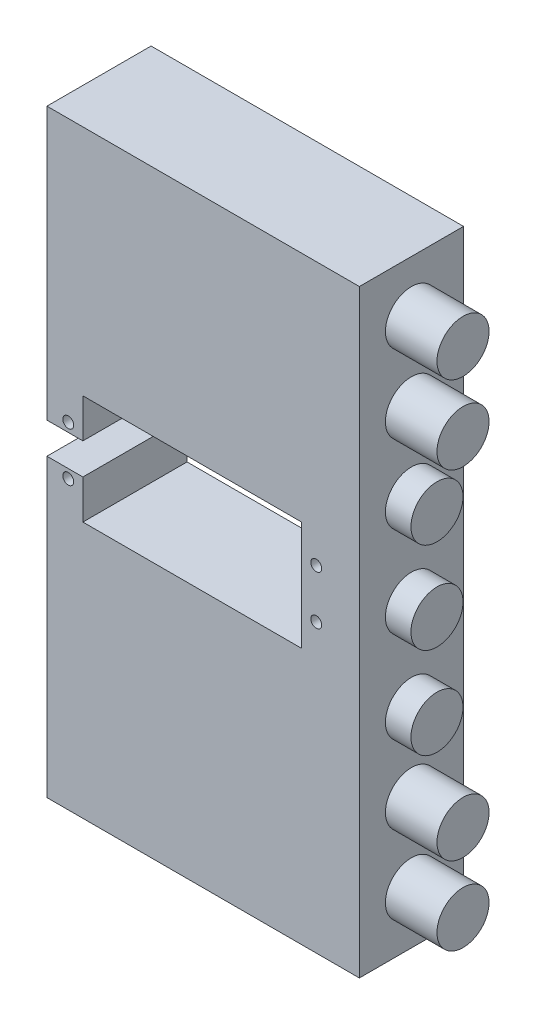
ISO-10303-21;
HEADER;
FILE_DESCRIPTION(('STEP AP214'),'2;1');
FILE_NAME('part.step','',(''),(''),'','','');
FILE_SCHEMA(('AUTOMOTIVE_DESIGN { 1 0 10303 214 1 1 1 1 }'));
ENDSEC;
DATA;
#1=APPLICATION_CONTEXT('core data for automotive mechanical design processes');
#2=APPLICATION_PROTOCOL_DEFINITION('international standard','automotive_design',2000,#1);
#3=PRODUCT_CONTEXT('',#1,'mechanical');
#4=PRODUCT('Part','Part','',(#3));
#5=PRODUCT_RELATED_PRODUCT_CATEGORY('part','',(#4));
#6=PRODUCT_DEFINITION_FORMATION('','',#4);
#7=PRODUCT_DEFINITION_CONTEXT('part definition',#1,'design');
#8=PRODUCT_DEFINITION('design','',#6,#7);
#9=PRODUCT_DEFINITION_SHAPE('','',#8);
#10=(LENGTH_UNIT() NAMED_UNIT(*) SI_UNIT(.MILLI.,.METRE.));
#11=(NAMED_UNIT(*) PLANE_ANGLE_UNIT() SI_UNIT($,.RADIAN.));
#12=(NAMED_UNIT(*) SI_UNIT($,.STERADIAN.) SOLID_ANGLE_UNIT());
#13=UNCERTAINTY_MEASURE_WITH_UNIT(LENGTH_MEASURE(1.E-05),#10,'distance_accuracy_value','');
#14=(GEOMETRIC_REPRESENTATION_CONTEXT(3) GLOBAL_UNCERTAINTY_ASSIGNED_CONTEXT((#13)) GLOBAL_UNIT_ASSIGNED_CONTEXT((#10,
#11,#12)) REPRESENTATION_CONTEXT('',''));
#15=CARTESIAN_POINT('',(0.,0.,0.));
#16=DIRECTION('',(0.,0.,1.));
#17=DIRECTION('',(1.,0.,0.));
#18=AXIS2_PLACEMENT_3D('',#15,#16,#17);
#19=CARTESIAN_POINT('',(55.0953192291233,52.2228621081059,20.));
#20=DIRECTION('',(1.,0.,0.));
#21=DIRECTION('',(0.,1.,0.));
#22=AXIS2_PLACEMENT_3D('',#19,#20,#21);
#23=PLANE('',#22);
#24=DIRECTION('',(0.,0.,1.));
#25=VECTOR('',#24,1.);
#26=CARTESIAN_POINT('',(55.0953192291233,-6.,20.));
#27=LINE('',#26,#25);
#28=CARTESIAN_POINT('',(55.0953192291233,-6.,0.));
#29=VERTEX_POINT('',#28);
#30=CARTESIAN_POINT('',(55.0953192291233,-6.,20.));
#31=VERTEX_POINT('',#30);
#32=EDGE_CURVE('E204',#29,#31,#27,.T.);
#33=ORIENTED_EDGE('',*,*,#32,.F.);
#34=DIRECTION('',(0.,-1.,0.));
#35=VECTOR('',#34,1.);
#36=CARTESIAN_POINT('',(55.0953192291233,52.2228621081059,0.));
#37=LINE('',#36,#35);
#38=CARTESIAN_POINT('',(55.0953192291233,-62.7771378918941,0.));
#39=VERTEX_POINT('',#38);
#40=EDGE_CURVE('E281',#29,#39,#37,.T.);
#41=ORIENTED_EDGE('',*,*,#40,.T.);
#42=DIRECTION('',(0.,0.,-1.));
#43=VECTOR('',#42,1.);
#44=CARTESIAN_POINT('',(55.0953192291233,-62.7771378918941,20.));
#45=LINE('',#44,#43);
#46=CARTESIAN_POINT('',(55.0953192291233,-62.7771378918941,20.));
#47=VERTEX_POINT('',#46);
#48=EDGE_CURVE('E315',#47,#39,#45,.T.);
#49=ORIENTED_EDGE('',*,*,#48,.F.);
#50=DIRECTION('',(0.,-1.,0.));
#51=VECTOR('',#50,1.);
#52=CARTESIAN_POINT('',(55.0953192291233,52.2228621081059,20.));
#53=LINE('',#52,#51);
#54=EDGE_CURVE('E152',#31,#47,#53,.T.);
#55=ORIENTED_EDGE('',*,*,#54,.F.);
#56=EDGE_LOOP('',(#33,#41,#49,#55));
#57=FACE_BOUND('',#56,.T.);
#58=ADVANCED_FACE('F99',(#57),#23,.F.);
#59=CARTESIAN_POINT('',(0.,0.,20.));
#60=DIRECTION('',(0.,0.,1.));
#61=DIRECTION('',(1.,0.,0.));
#62=AXIS2_PLACEMENT_3D('',#59,#60,#61);
#63=PLANE('',#62);
#64=CARTESIAN_POINT('',(106.81,1.7,20.));
#65=DIRECTION('',(0.,0.,1.));
#66=DIRECTION('',(1.,0.,0.));
#67=AXIS2_PLACEMENT_3D('',#64,#65,#66);
#68=CIRCLE('',#67,1.04999999999999);
#69=CARTESIAN_POINT('',(107.86,1.7,20.));
#70=VERTEX_POINT('',#69);
#71=EDGE_CURVE('E724',#70,#70,#68,.T.);
#72=ORIENTED_EDGE('',*,*,#71,.F.);
#73=EDGE_LOOP('',(#72));
#74=FACE_BOUND('',#73,.T.);
#75=DIRECTION('',(0.,-1.,0.));
#76=VECTOR('',#75,1.);
#77=CARTESIAN_POINT('',(62.,-6.,20.));
#78=LINE('',#77,#76);
#79=CARTESIAN_POINT('',(62.,-6.,20.));
#80=VERTEX_POINT('',#79);
#81=CARTESIAN_POINT('',(62.,-13.5,20.));
#82=VERTEX_POINT('',#81);
#83=EDGE_CURVE('E207',#80,#82,#78,.T.);
#84=ORIENTED_EDGE('',*,*,#83,.F.);
#85=DIRECTION('',(1.,0.,0.));
#86=VECTOR('',#85,1.);
#87=CARTESIAN_POINT('',(55.,-6.,20.));
#88=LINE('',#87,#86);
#89=EDGE_CURVE('E198',#31,#80,#88,.T.);
#90=ORIENTED_EDGE('',*,*,#89,.F.);
#91=ORIENTED_EDGE('',*,*,#54,.T.);
#92=DIRECTION('',(1.,0.,0.));
#93=VECTOR('',#92,1.);
#94=CARTESIAN_POINT('',(55.0953192291233,-62.7771378918941,20.));
#95=LINE('',#94,#93);
#96=CARTESIAN_POINT('',(115.095319229123,-62.7771378918941,20.));
#97=VERTEX_POINT('',#96);
#98=EDGE_CURVE('E285',#47,#97,#95,.T.);
#99=ORIENTED_EDGE('',*,*,#98,.T.);
#100=DIRECTION('',(0.,1.,0.));
#101=VECTOR('',#100,1.);
#102=CARTESIAN_POINT('',(115.095319229123,52.2228621081059,20.));
#103=LINE('',#102,#101);
#104=CARTESIAN_POINT('',(115.095319229123,52.2228621081059,20.));
#105=VERTEX_POINT('',#104);
#106=EDGE_CURVE('E288',#97,#105,#103,.T.);
#107=ORIENTED_EDGE('',*,*,#106,.T.);
#108=DIRECTION('',(-1.,0.,0.));
#109=VECTOR('',#108,1.);
#110=CARTESIAN_POINT('',(55.0953192291233,52.2228621081059,20.));
#111=LINE('',#110,#109);
#112=CARTESIAN_POINT('',(55.0953192291233,52.2228621081059,20.));
#113=VERTEX_POINT('',#112);
#114=EDGE_CURVE('E124',#105,#113,#111,.T.);
#115=ORIENTED_EDGE('',*,*,#114,.T.);
#116=CARTESIAN_POINT('',(55.0953192291233,0.,20.));
#117=VERTEX_POINT('',#116);
#118=EDGE_CURVE('E282',#113,#117,#53,.T.);
#119=ORIENTED_EDGE('',*,*,#118,.T.);
#120=DIRECTION('',(1.,0.,0.));
#121=VECTOR('',#120,1.);
#122=CARTESIAN_POINT('',(55.,0.,20.));
#123=LINE('',#122,#121);
#124=CARTESIAN_POINT('',(62.,0.,20.));
#125=VERTEX_POINT('',#124);
#126=EDGE_CURVE('E240',#117,#125,#123,.T.);
#127=ORIENTED_EDGE('',*,*,#126,.T.);
#128=DIRECTION('',(0.,1.,0.));
#129=VECTOR('',#128,1.);
#130=CARTESIAN_POINT('',(62.,0.,20.));
#131=LINE('',#130,#129);
#132=CARTESIAN_POINT('',(62.,7.5,20.));
#133=VERTEX_POINT('',#132);
#134=EDGE_CURVE('E236',#125,#133,#131,.T.);
#135=ORIENTED_EDGE('',*,*,#134,.T.);
#136=DIRECTION('',(1.,0.,0.));
#137=VECTOR('',#136,1.);
#138=CARTESIAN_POINT('',(62.,7.5,20.));
#139=LINE('',#138,#137);
#140=CARTESIAN_POINT('',(104.,7.5,20.));
#141=VERTEX_POINT('',#140);
#142=EDGE_CURVE('E232',#133,#141,#139,.T.);
#143=ORIENTED_EDGE('',*,*,#142,.T.);
#144=DIRECTION('',(0.,-1.,0.));
#145=VECTOR('',#144,1.);
#146=CARTESIAN_POINT('',(104.,7.5,20.));
#147=LINE('',#146,#145);
#148=CARTESIAN_POINT('',(104.,-13.5,20.));
#149=VERTEX_POINT('',#148);
#150=EDGE_CURVE('E226',#141,#149,#147,.T.);
#151=ORIENTED_EDGE('',*,*,#150,.T.);
#152=DIRECTION('',(1.,0.,0.));
#153=VECTOR('',#152,1.);
#154=CARTESIAN_POINT('',(62.,-13.5,20.));
#155=LINE('',#154,#153);
#156=EDGE_CURVE('E222',#82,#149,#155,.T.);
#157=ORIENTED_EDGE('',*,*,#156,.F.);
#158=EDGE_LOOP('',(#84,#90,#91,#99,#107,#115,#119,#127,#135,#143,#151,#157));
#159=FACE_BOUND('',#158,.T.);
#160=CARTESIAN_POINT('',(106.81,-7.7,20.));
#161=DIRECTION('',(0.,0.,-1.));
#162=DIRECTION('',(-1.,0.,0.));
#163=AXIS2_PLACEMENT_3D('',#160,#161,#162);
#164=CIRCLE('',#163,1.04999999999999);
#165=CARTESIAN_POINT('',(105.76,-7.7,20.));
#166=VERTEX_POINT('',#165);
#167=EDGE_CURVE('E732',#166,#166,#164,.T.);
#168=ORIENTED_EDGE('',*,*,#167,.T.);
#169=EDGE_LOOP('',(#168));
#170=FACE_BOUND('',#169,.T.);
#171=CARTESIAN_POINT('',(59.19,-7.7,20.));
#172=DIRECTION('',(0.,0.,-1.));
#173=DIRECTION('',(-1.,0.,0.));
#174=AXIS2_PLACEMENT_3D('',#171,#172,#173);
#175=CIRCLE('',#174,1.05);
#176=CARTESIAN_POINT('',(58.14,-7.7,20.));
#177=VERTEX_POINT('',#176);
#178=EDGE_CURVE('E740',#177,#177,#175,.T.);
#179=ORIENTED_EDGE('',*,*,#178,.T.);
#180=EDGE_LOOP('',(#179));
#181=FACE_BOUND('',#180,.T.);
#182=CARTESIAN_POINT('',(59.19,1.7,20.));
#183=DIRECTION('',(0.,0.,1.));
#184=DIRECTION('',(1.,0.,0.));
#185=AXIS2_PLACEMENT_3D('',#182,#183,#184);
#186=CIRCLE('',#185,1.05);
#187=CARTESIAN_POINT('',(60.24,1.7,20.));
#188=VERTEX_POINT('',#187);
#189=EDGE_CURVE('E720',#188,#188,#186,.T.);
#190=ORIENTED_EDGE('',*,*,#189,.F.);
#191=EDGE_LOOP('',(#190));
#192=FACE_BOUND('',#191,.T.);
#193=ADVANCED_FACE('F219',(#74,#159,#170,#181,#192),#63,.T.);
#194=CARTESIAN_POINT('',(0.,0.,0.));
#195=DIRECTION('',(0.,0.,1.));
#196=DIRECTION('',(1.,0.,0.));
#197=AXIS2_PLACEMENT_3D('',#194,#195,#196);
#198=PLANE('',#197);
#199=CARTESIAN_POINT('',(59.19,-7.7,0.));
#200=DIRECTION('',(0.,0.,-1.));
#201=DIRECTION('',(-1.,0.,0.));
#202=AXIS2_PLACEMENT_3D('',#199,#200,#201);
#203=CIRCLE('',#202,1.05);
#204=CARTESIAN_POINT('',(58.14,-7.7,0.));
#205=VERTEX_POINT('',#204);
#206=EDGE_CURVE('E736',#205,#205,#203,.T.);
#207=ORIENTED_EDGE('',*,*,#206,.F.);
#208=EDGE_LOOP('',(#207));
#209=FACE_BOUND('',#208,.T.);
#210=CARTESIAN_POINT('',(106.81,-7.7,0.));
#211=DIRECTION('',(0.,0.,-1.));
#212=DIRECTION('',(-1.,0.,0.));
#213=AXIS2_PLACEMENT_3D('',#210,#211,#212);
#214=CIRCLE('',#213,1.04999999999999);
#215=CARTESIAN_POINT('',(105.76,-7.7,0.));
#216=VERTEX_POINT('',#215);
#217=EDGE_CURVE('E728',#216,#216,#214,.T.);
#218=ORIENTED_EDGE('',*,*,#217,.F.);
#219=EDGE_LOOP('',(#218));
#220=FACE_BOUND('',#219,.T.);
#221=DIRECTION('',(-1.,0.,0.));
#222=VECTOR('',#221,1.);
#223=CARTESIAN_POINT('',(0.,-6.,0.));
#224=LINE('',#223,#222);
#225=CARTESIAN_POINT('',(62.,-6.,0.));
#226=VERTEX_POINT('',#225);
#227=EDGE_CURVE('E322',#226,#29,#224,.T.);
#228=ORIENTED_EDGE('',*,*,#227,.F.);
#229=DIRECTION('',(0.,-1.,0.));
#230=VECTOR('',#229,1.);
#231=CARTESIAN_POINT('',(62.,-6.,0.));
#232=LINE('',#231,#230);
#233=CARTESIAN_POINT('',(62.,-13.5,0.));
#234=VERTEX_POINT('',#233);
#235=EDGE_CURVE('E214',#226,#234,#232,.T.);
#236=ORIENTED_EDGE('',*,*,#235,.T.);
#237=DIRECTION('',(1.,0.,0.));
#238=VECTOR('',#237,1.);
#239=CARTESIAN_POINT('',(62.,-13.5,0.));
#240=LINE('',#239,#238);
#241=CARTESIAN_POINT('',(104.,-13.5,0.));
#242=VERTEX_POINT('',#241);
#243=EDGE_CURVE('E247',#234,#242,#240,.T.);
#244=ORIENTED_EDGE('',*,*,#243,.T.);
#245=DIRECTION('',(0.,-1.,0.));
#246=VECTOR('',#245,1.);
#247=CARTESIAN_POINT('',(104.,7.5,0.));
#248=LINE('',#247,#246);
#249=CARTESIAN_POINT('',(104.,7.5,0.));
#250=VERTEX_POINT('',#249);
#251=EDGE_CURVE('E252',#250,#242,#248,.T.);
#252=ORIENTED_EDGE('',*,*,#251,.F.);
#253=DIRECTION('',(1.,0.,0.));
#254=VECTOR('',#253,1.);
#255=CARTESIAN_POINT('',(62.,7.5,0.));
#256=LINE('',#255,#254);
#257=CARTESIAN_POINT('',(62.,7.5,0.));
#258=VERTEX_POINT('',#257);
#259=EDGE_CURVE('E256',#258,#250,#256,.T.);
#260=ORIENTED_EDGE('',*,*,#259,.F.);
#261=DIRECTION('',(0.,1.,0.));
#262=VECTOR('',#261,1.);
#263=CARTESIAN_POINT('',(62.,0.,0.));
#264=LINE('',#263,#262);
#265=CARTESIAN_POINT('',(62.,0.,0.));
#266=VERTEX_POINT('',#265);
#267=EDGE_CURVE('E208',#266,#258,#264,.T.);
#268=ORIENTED_EDGE('',*,*,#267,.F.);
#269=DIRECTION('',(-1.,0.,0.));
#270=VECTOR('',#269,1.);
#271=CARTESIAN_POINT('',(0.,0.,0.));
#272=LINE('',#271,#270);
#273=CARTESIAN_POINT('',(55.0953192291233,0.,0.));
#274=VERTEX_POINT('',#273);
#275=EDGE_CURVE('E319',#266,#274,#272,.T.);
#276=ORIENTED_EDGE('',*,*,#275,.T.);
#277=CARTESIAN_POINT('',(55.0953192291233,52.2228621081059,0.));
#278=VERTEX_POINT('',#277);
#279=EDGE_CURVE('E294',#278,#274,#37,.T.);
#280=ORIENTED_EDGE('',*,*,#279,.F.);
#281=DIRECTION('',(-1.,0.,0.));
#282=VECTOR('',#281,1.);
#283=CARTESIAN_POINT('',(55.0953192291233,52.2228621081059,0.));
#284=LINE('',#283,#282);
#285=CARTESIAN_POINT('',(115.095319229123,52.2228621081059,0.));
#286=VERTEX_POINT('',#285);
#287=EDGE_CURVE('E145',#286,#278,#284,.T.);
#288=ORIENTED_EDGE('',*,*,#287,.F.);
#289=DIRECTION('',(0.,1.,0.));
#290=VECTOR('',#289,1.);
#291=CARTESIAN_POINT('',(115.095319229123,52.2228621081059,0.));
#292=LINE('',#291,#290);
#293=CARTESIAN_POINT('',(115.095319229123,-62.7771378918941,0.));
#294=VERTEX_POINT('',#293);
#295=EDGE_CURVE('E301',#294,#286,#292,.T.);
#296=ORIENTED_EDGE('',*,*,#295,.F.);
#297=DIRECTION('',(1.,0.,0.));
#298=VECTOR('',#297,1.);
#299=CARTESIAN_POINT('',(55.0953192291233,-62.7771378918941,0.));
#300=LINE('',#299,#298);
#301=EDGE_CURVE('E298',#39,#294,#300,.T.);
#302=ORIENTED_EDGE('',*,*,#301,.F.);
#303=ORIENTED_EDGE('',*,*,#40,.F.);
#304=EDGE_LOOP('',(#228,#236,#244,#252,#260,#268,#276,#280,#288,#296,#302,#303));
#305=FACE_BOUND('',#304,.T.);
#306=CARTESIAN_POINT('',(106.81,1.7,0.));
#307=DIRECTION('',(0.,0.,1.));
#308=DIRECTION('',(1.,0.,0.));
#309=AXIS2_PLACEMENT_3D('',#306,#307,#308);
#310=CIRCLE('',#309,1.04999999999999);
#311=CARTESIAN_POINT('',(107.86,1.7,0.));
#312=VERTEX_POINT('',#311);
#313=EDGE_CURVE('E248',#312,#312,#310,.T.);
#314=ORIENTED_EDGE('',*,*,#313,.T.);
#315=EDGE_LOOP('',(#314));
#316=FACE_BOUND('',#315,.T.);
#317=CARTESIAN_POINT('',(59.19,1.7,0.));
#318=DIRECTION('',(0.,0.,1.));
#319=DIRECTION('',(1.,0.,0.));
#320=AXIS2_PLACEMENT_3D('',#317,#318,#319);
#321=CIRCLE('',#320,1.05);
#322=CARTESIAN_POINT('',(60.24,1.7,0.));
#323=VERTEX_POINT('',#322);
#324=EDGE_CURVE('E744',#323,#323,#321,.T.);
#325=ORIENTED_EDGE('',*,*,#324,.T.);
#326=EDGE_LOOP('',(#325));
#327=FACE_BOUND('',#326,.T.);
#328=ADVANCED_FACE('F374',(#209,#220,#305,#316,#327),#198,.F.);
#329=ORIENTED_EDGE('',*,*,#279,.T.);
#330=DIRECTION('',(0.,0.,1.));
#331=VECTOR('',#330,1.);
#332=CARTESIAN_POINT('',(55.0953192291233,0.,20.));
#333=LINE('',#332,#331);
#334=EDGE_CURVE('E115',#274,#117,#333,.T.);
#335=ORIENTED_EDGE('',*,*,#334,.T.);
#336=ORIENTED_EDGE('',*,*,#118,.F.);
#337=DIRECTION('',(0.,0.,-1.));
#338=VECTOR('',#337,1.);
#339=CARTESIAN_POINT('',(55.0953192291233,52.2228621081059,20.));
#340=LINE('',#339,#338);
#341=EDGE_CURVE('E293',#113,#278,#340,.T.);
#342=ORIENTED_EDGE('',*,*,#341,.T.);
#343=EDGE_LOOP('',(#329,#335,#336,#342));
#344=FACE_BOUND('',#343,.T.);
#345=ADVANCED_FACE('F101',(#344),#23,.F.);
#346=CARTESIAN_POINT('',(55.0953192291233,-62.7771378918941,20.));
#347=DIRECTION('',(0.,1.,0.));
#348=DIRECTION('',(0.,0.,1.));
#349=AXIS2_PLACEMENT_3D('',#346,#347,#348);
#350=PLANE('',#349);
#351=ORIENTED_EDGE('',*,*,#301,.T.);
#352=DIRECTION('',(0.,0.,-1.));
#353=VECTOR('',#352,1.);
#354=CARTESIAN_POINT('',(115.095319229123,-62.7771378918941,20.));
#355=LINE('',#354,#353);
#356=EDGE_CURVE('E311',#97,#294,#355,.T.);
#357=ORIENTED_EDGE('',*,*,#356,.F.);
#358=ORIENTED_EDGE('',*,*,#98,.F.);
#359=ORIENTED_EDGE('',*,*,#48,.T.);
#360=EDGE_LOOP('',(#351,#357,#358,#359));
#361=FACE_BOUND('',#360,.T.);
#362=ADVANCED_FACE('F354',(#361),#350,.F.);
#363=CARTESIAN_POINT('',(115.095319229123,52.2228621081059,20.));
#364=DIRECTION('',(-1.,0.,0.));
#365=DIRECTION('',(0.,0.,1.));
#366=AXIS2_PLACEMENT_3D('',#363,#364,#365);
#367=PLANE('',#366);
#368=CARTESIAN_POINT('',(115.095319229123,-22.7771378918941,9.99999999999999));
#369=DIRECTION('',(-1.,0.,0.));
#370=DIRECTION('',(0.,0.,1.));
#371=AXIS2_PLACEMENT_3D('',#368,#369,#370);
#372=CIRCLE('',#371,5.);
#373=CARTESIAN_POINT('',(115.095319229123,-22.7771378918941,15.));
#374=VERTEX_POINT('',#373);
#375=EDGE_CURVE('E12',#374,#374,#372,.F.);
#376=ORIENTED_EDGE('',*,*,#375,.F.);
#377=EDGE_LOOP('',(#376));
#378=FACE_BOUND('',#377,.T.);
#379=CARTESIAN_POINT('',(115.095319229123,-5.27713789189415,10.));
#380=DIRECTION('',(-1.,0.,0.));
#381=DIRECTION('',(0.,0.,1.));
#382=AXIS2_PLACEMENT_3D('',#379,#380,#381);
#383=CIRCLE('',#382,5.);
#384=CARTESIAN_POINT('',(115.095319229123,-5.27713789189415,15.));
#385=VERTEX_POINT('',#384);
#386=EDGE_CURVE('E108',#385,#385,#383,.F.);
#387=ORIENTED_EDGE('',*,*,#386,.F.);
#388=EDGE_LOOP('',(#387));
#389=FACE_BOUND('',#388,.T.);
#390=CARTESIAN_POINT('',(115.095319229123,12.2228621081058,9.99999999999999));
#391=DIRECTION('',(-1.,0.,0.));
#392=DIRECTION('',(0.,0.,1.));
#393=AXIS2_PLACEMENT_3D('',#390,#391,#392);
#394=CIRCLE('',#393,5.);
#395=CARTESIAN_POINT('',(115.095319229123,12.2228621081058,15.));
#396=VERTEX_POINT('',#395);
#397=EDGE_CURVE('E341',#396,#396,#394,.F.);
#398=ORIENTED_EDGE('',*,*,#397,.F.);
#399=EDGE_LOOP('',(#398));
#400=FACE_BOUND('',#399,.T.);
#401=CARTESIAN_POINT('',(115.095319229123,-52.7771378918941,10.));
#402=DIRECTION('',(-1.,0.,0.));
#403=DIRECTION('',(0.,0.,1.));
#404=AXIS2_PLACEMENT_3D('',#401,#402,#403);
#405=CIRCLE('',#404,5.);
#406=CARTESIAN_POINT('',(115.095319229123,-52.7771378918941,15.));
#407=VERTEX_POINT('',#406);
#408=EDGE_CURVE('E337',#407,#407,#405,.F.);
#409=ORIENTED_EDGE('',*,*,#408,.F.);
#410=EDGE_LOOP('',(#409));
#411=FACE_BOUND('',#410,.T.);
#412=CARTESIAN_POINT('',(115.095319229123,-37.7771378918941,10.));
#413=DIRECTION('',(-1.,0.,0.));
#414=DIRECTION('',(0.,0.,1.));
#415=AXIS2_PLACEMENT_3D('',#412,#413,#414);
#416=CIRCLE('',#415,5.);
#417=CARTESIAN_POINT('',(115.095319229123,-37.7771378918941,15.));
#418=VERTEX_POINT('',#417);
#419=EDGE_CURVE('E333',#418,#418,#416,.F.);
#420=ORIENTED_EDGE('',*,*,#419,.F.);
#421=EDGE_LOOP('',(#420));
#422=FACE_BOUND('',#421,.T.);
#423=CARTESIAN_POINT('',(115.095319229123,27.2228621081059,10.));
#424=DIRECTION('',(-1.,0.,0.));
#425=DIRECTION('',(0.,0.,1.));
#426=AXIS2_PLACEMENT_3D('',#423,#424,#425);
#427=CIRCLE('',#426,5.);
#428=CARTESIAN_POINT('',(115.095319229123,27.2228621081059,15.));
#429=VERTEX_POINT('',#428);
#430=EDGE_CURVE('E329',#429,#429,#427,.F.);
#431=ORIENTED_EDGE('',*,*,#430,.F.);
#432=EDGE_LOOP('',(#431));
#433=FACE_BOUND('',#432,.T.);
#434=CARTESIAN_POINT('',(115.095319229123,42.2228621081059,10.));
#435=DIRECTION('',(-1.,0.,0.));
#436=DIRECTION('',(0.,0.,1.));
#437=AXIS2_PLACEMENT_3D('',#434,#435,#436);
#438=CIRCLE('',#437,5.);
#439=CARTESIAN_POINT('',(115.095319229123,42.2228621081059,15.));
#440=VERTEX_POINT('',#439);
#441=EDGE_CURVE('E325',#440,#440,#438,.F.);
#442=ORIENTED_EDGE('',*,*,#441,.F.);
#443=EDGE_LOOP('',(#442));
#444=FACE_BOUND('',#443,.T.);
#445=ORIENTED_EDGE('',*,*,#295,.T.);
#446=DIRECTION('',(0.,0.,-1.));
#447=VECTOR('',#446,1.);
#448=CARTESIAN_POINT('',(115.095319229123,52.2228621081059,20.));
#449=LINE('',#448,#447);
#450=EDGE_CURVE('E308',#105,#286,#449,.T.);
#451=ORIENTED_EDGE('',*,*,#450,.F.);
#452=ORIENTED_EDGE('',*,*,#106,.F.);
#453=ORIENTED_EDGE('',*,*,#356,.T.);
#454=EDGE_LOOP('',(#445,#451,#452,#453));
#455=FACE_BOUND('',#454,.T.);
#456=ADVANCED_FACE('F350',(#378,#389,#400,#411,#422,#433,#444,#455),#367,.F.);
#457=CARTESIAN_POINT('',(55.0953192291233,52.2228621081059,20.));
#458=DIRECTION('',(0.,-1.,0.));
#459=DIRECTION('',(0.,0.,-1.));
#460=AXIS2_PLACEMENT_3D('',#457,#458,#459);
#461=PLANE('',#460);
#462=ORIENTED_EDGE('',*,*,#287,.T.);
#463=ORIENTED_EDGE('',*,*,#341,.F.);
#464=ORIENTED_EDGE('',*,*,#114,.F.);
#465=ORIENTED_EDGE('',*,*,#450,.T.);
#466=EDGE_LOOP('',(#462,#463,#464,#465));
#467=FACE_BOUND('',#466,.T.);
#468=ADVANCED_FACE('F353',(#467),#461,.F.);
#469=CARTESIAN_POINT('',(55.,-6.,20.));
#470=DIRECTION('',(0.,1.,0.));
#471=DIRECTION('',(0.,0.,1.));
#472=AXIS2_PLACEMENT_3D('',#469,#470,#471);
#473=PLANE('',#472);
#474=ORIENTED_EDGE('',*,*,#32,.T.);
#475=ORIENTED_EDGE('',*,*,#89,.T.);
#476=DIRECTION('',(0.,0.,-1.));
#477=VECTOR('',#476,1.);
#478=CARTESIAN_POINT('',(62.,-6.,20.));
#479=LINE('',#478,#477);
#480=EDGE_CURVE('E201',#80,#226,#479,.T.);
#481=ORIENTED_EDGE('',*,*,#480,.T.);
#482=ORIENTED_EDGE('',*,*,#227,.T.);
#483=EDGE_LOOP('',(#474,#475,#481,#482));
#484=FACE_BOUND('',#483,.T.);
#485=ADVANCED_FACE('F200',(#484),#473,.T.);
#486=CARTESIAN_POINT('',(55.,0.,20.));
#487=DIRECTION('',(0.,1.,0.));
#488=DIRECTION('',(0.,0.,1.));
#489=AXIS2_PLACEMENT_3D('',#486,#487,#488);
#490=PLANE('',#489);
#491=ORIENTED_EDGE('',*,*,#275,.F.);
#492=DIRECTION('',(0.,0.,-1.));
#493=VECTOR('',#492,1.);
#494=CARTESIAN_POINT('',(62.,0.,20.));
#495=LINE('',#494,#493);
#496=EDGE_CURVE('E244',#125,#266,#495,.T.);
#497=ORIENTED_EDGE('',*,*,#496,.F.);
#498=ORIENTED_EDGE('',*,*,#126,.F.);
#499=ORIENTED_EDGE('',*,*,#334,.F.);
#500=EDGE_LOOP('',(#491,#497,#498,#499));
#501=FACE_BOUND('',#500,.T.);
#502=ADVANCED_FACE('F380',(#501),#490,.F.);
#503=CARTESIAN_POINT('',(62.,-6.,20.));
#504=DIRECTION('',(1.,0.,0.));
#505=DIRECTION('',(0.,1.,0.));
#506=AXIS2_PLACEMENT_3D('',#503,#504,#505);
#507=PLANE('',#506);
#508=ORIENTED_EDGE('',*,*,#235,.F.);
#509=ORIENTED_EDGE('',*,*,#480,.F.);
#510=ORIENTED_EDGE('',*,*,#83,.T.);
#511=DIRECTION('',(0.,0.,-1.));
#512=VECTOR('',#511,1.);
#513=CARTESIAN_POINT('',(62.,-13.5,20.));
#514=LINE('',#513,#512);
#515=EDGE_CURVE('E216',#82,#234,#514,.T.);
#516=ORIENTED_EDGE('',*,*,#515,.T.);
#517=EDGE_LOOP('',(#508,#509,#510,#516));
#518=FACE_BOUND('',#517,.T.);
#519=ADVANCED_FACE('F211',(#518),#507,.T.);
#520=CARTESIAN_POINT('',(62.,-13.5,20.));
#521=DIRECTION('',(0.,1.,0.));
#522=DIRECTION('',(0.,0.,1.));
#523=AXIS2_PLACEMENT_3D('',#520,#521,#522);
#524=PLANE('',#523);
#525=ORIENTED_EDGE('',*,*,#243,.F.);
#526=ORIENTED_EDGE('',*,*,#515,.F.);
#527=ORIENTED_EDGE('',*,*,#156,.T.);
#528=DIRECTION('',(0.,0.,-1.));
#529=VECTOR('',#528,1.);
#530=CARTESIAN_POINT('',(104.,-13.5,20.));
#531=LINE('',#530,#529);
#532=EDGE_CURVE('E272',#149,#242,#531,.T.);
#533=ORIENTED_EDGE('',*,*,#532,.T.);
#534=EDGE_LOOP('',(#525,#526,#527,#533));
#535=FACE_BOUND('',#534,.T.);
#536=ADVANCED_FACE('F394',(#535),#524,.T.);
#537=CARTESIAN_POINT('',(104.,7.5,20.));
#538=DIRECTION('',(1.,0.,0.));
#539=DIRECTION('',(0.,0.,-1.));
#540=AXIS2_PLACEMENT_3D('',#537,#538,#539);
#541=PLANE('',#540);
#542=ORIENTED_EDGE('',*,*,#251,.T.);
#543=ORIENTED_EDGE('',*,*,#532,.F.);
#544=ORIENTED_EDGE('',*,*,#150,.F.);
#545=DIRECTION('',(0.,0.,-1.));
#546=VECTOR('',#545,1.);
#547=CARTESIAN_POINT('',(104.,7.5,20.));
#548=LINE('',#547,#546);
#549=EDGE_CURVE('E269',#141,#250,#548,.T.);
#550=ORIENTED_EDGE('',*,*,#549,.T.);
#551=EDGE_LOOP('',(#542,#543,#544,#550));
#552=FACE_BOUND('',#551,.T.);
#553=ADVANCED_FACE('F390',(#552),#541,.F.);
#554=CARTESIAN_POINT('',(62.,7.5,20.));
#555=DIRECTION('',(0.,1.,0.));
#556=DIRECTION('',(0.,0.,1.));
#557=AXIS2_PLACEMENT_3D('',#554,#555,#556);
#558=PLANE('',#557);
#559=ORIENTED_EDGE('',*,*,#259,.T.);
#560=ORIENTED_EDGE('',*,*,#549,.F.);
#561=ORIENTED_EDGE('',*,*,#142,.F.);
#562=DIRECTION('',(0.,0.,-1.));
#563=VECTOR('',#562,1.);
#564=CARTESIAN_POINT('',(62.,7.5,20.));
#565=LINE('',#564,#563);
#566=EDGE_CURVE('E266',#133,#258,#565,.T.);
#567=ORIENTED_EDGE('',*,*,#566,.T.);
#568=EDGE_LOOP('',(#559,#560,#561,#567));
#569=FACE_BOUND('',#568,.T.);
#570=ADVANCED_FACE('F386',(#569),#558,.F.);
#571=CARTESIAN_POINT('',(62.,0.,20.));
#572=DIRECTION('',(-1.,0.,0.));
#573=DIRECTION('',(0.,-1.,0.));
#574=AXIS2_PLACEMENT_3D('',#571,#572,#573);
#575=PLANE('',#574);
#576=ORIENTED_EDGE('',*,*,#267,.T.);
#577=ORIENTED_EDGE('',*,*,#566,.F.);
#578=ORIENTED_EDGE('',*,*,#134,.F.);
#579=ORIENTED_EDGE('',*,*,#496,.T.);
#580=EDGE_LOOP('',(#576,#577,#578,#579));
#581=FACE_BOUND('',#580,.T.);
#582=ADVANCED_FACE('F382',(#581),#575,.F.);
#583=CARTESIAN_POINT('',(106.81,1.7,20.));
#584=DIRECTION('',(0.,0.,-1.));
#585=DIRECTION('',(-1.,0.,0.));
#586=AXIS2_PLACEMENT_3D('',#583,#584,#585);
#587=CYLINDRICAL_SURFACE('',#586,1.04999999999999);
#588=ORIENTED_EDGE('',*,*,#71,.T.);
#589=EDGE_LOOP('',(#588));
#590=FACE_BOUND('',#589,.T.);
#591=ORIENTED_EDGE('',*,*,#313,.F.);
#592=EDGE_LOOP('',(#591));
#593=FACE_BOUND('',#592,.T.);
#594=ADVANCED_FACE('F437',(#590,#593),#587,.F.);
#595=CARTESIAN_POINT('',(106.81,-7.7,20.));
#596=DIRECTION('',(0.,0.,-1.));
#597=DIRECTION('',(-1.,0.,0.));
#598=AXIS2_PLACEMENT_3D('',#595,#596,#597);
#599=CYLINDRICAL_SURFACE('',#598,1.04999999999999);
#600=ORIENTED_EDGE('',*,*,#167,.F.);
#601=EDGE_LOOP('',(#600));
#602=FACE_BOUND('',#601,.T.);
#603=ORIENTED_EDGE('',*,*,#217,.T.);
#604=EDGE_LOOP('',(#603));
#605=FACE_BOUND('',#604,.T.);
#606=ADVANCED_FACE('F465',(#602,#605),#599,.F.);
#607=CARTESIAN_POINT('',(59.19,-7.7,20.));
#608=DIRECTION('',(0.,0.,-1.));
#609=DIRECTION('',(-1.,0.,0.));
#610=AXIS2_PLACEMENT_3D('',#607,#608,#609);
#611=CYLINDRICAL_SURFACE('',#610,1.05);
#612=ORIENTED_EDGE('',*,*,#178,.F.);
#613=EDGE_LOOP('',(#612));
#614=FACE_BOUND('',#613,.T.);
#615=ORIENTED_EDGE('',*,*,#206,.T.);
#616=EDGE_LOOP('',(#615));
#617=FACE_BOUND('',#616,.T.);
#618=ADVANCED_FACE('F473',(#614,#617),#611,.F.);
#619=CARTESIAN_POINT('',(59.19,1.7,20.));
#620=DIRECTION('',(0.,0.,-1.));
#621=DIRECTION('',(-1.,0.,0.));
#622=AXIS2_PLACEMENT_3D('',#619,#620,#621);
#623=CYLINDRICAL_SURFACE('',#622,1.05);
#624=ORIENTED_EDGE('',*,*,#189,.T.);
#625=EDGE_LOOP('',(#624));
#626=FACE_BOUND('',#625,.T.);
#627=ORIENTED_EDGE('',*,*,#324,.F.);
#628=EDGE_LOOP('',(#627));
#629=FACE_BOUND('',#628,.T.);
#630=ADVANCED_FACE('F433',(#626,#629),#623,.F.);
#631=CARTESIAN_POINT('',(125.,42.2228621081059,10.));
#632=DIRECTION('',(-1.,0.,0.));
#633=DIRECTION('',(0.,0.,1.));
#634=AXIS2_PLACEMENT_3D('',#631,#632,#633);
#635=CYLINDRICAL_SURFACE('',#634,5.);
#636=CARTESIAN_POINT('',(125.,42.2228621081059,10.));
#637=DIRECTION('',(1.,0.,0.));
#638=DIRECTION('',(0.,0.,-1.));
#639=AXIS2_PLACEMENT_3D('',#636,#637,#638);
#640=CIRCLE('',#639,5.);
#641=CARTESIAN_POINT('',(125.,42.2228621081059,5.));
#642=VERTEX_POINT('',#641);
#643=EDGE_CURVE('E716',#642,#642,#640,.T.);
#644=ORIENTED_EDGE('',*,*,#643,.F.);
#645=EDGE_LOOP('',(#644));
#646=FACE_BOUND('',#645,.T.);
#647=ORIENTED_EDGE('',*,*,#441,.T.);
#648=EDGE_LOOP('',(#647));
#649=FACE_BOUND('',#648,.T.);
#650=ADVANCED_FACE('F487',(#646,#649),#635,.T.);
#651=CARTESIAN_POINT('',(125.,42.2228621081059,10.));
#652=DIRECTION('',(1.,0.,0.));
#653=DIRECTION('',(0.,0.,-1.));
#654=AXIS2_PLACEMENT_3D('',#651,#652,#653);
#655=PLANE('',#654);
#656=ORIENTED_EDGE('',*,*,#643,.T.);
#657=EDGE_LOOP('',(#656));
#658=FACE_BOUND('',#657,.T.);
#659=ADVANCED_FACE('F494',(#658),#655,.T.);
#660=CARTESIAN_POINT('',(125.,27.2228621081059,10.));
#661=DIRECTION('',(-1.,0.,0.));
#662=DIRECTION('',(0.,0.,1.));
#663=AXIS2_PLACEMENT_3D('',#660,#661,#662);
#664=CYLINDRICAL_SURFACE('',#663,5.);
#665=CARTESIAN_POINT('',(125.,27.2228621081059,10.));
#666=DIRECTION('',(1.,0.,0.));
#667=DIRECTION('',(0.,0.,-1.));
#668=AXIS2_PLACEMENT_3D('',#665,#666,#667);
#669=CIRCLE('',#668,5.);
#670=CARTESIAN_POINT('',(125.,27.2228621081059,5.));
#671=VERTEX_POINT('',#670);
#672=EDGE_CURVE('E712',#671,#671,#669,.T.);
#673=ORIENTED_EDGE('',*,*,#672,.F.);
#674=EDGE_LOOP('',(#673));
#675=FACE_BOUND('',#674,.T.);
#676=ORIENTED_EDGE('',*,*,#430,.T.);
#677=EDGE_LOOP('',(#676));
#678=FACE_BOUND('',#677,.T.);
#679=ADVANCED_FACE('F502',(#675,#678),#664,.T.);
#680=CARTESIAN_POINT('',(125.,27.2228621081059,10.));
#681=DIRECTION('',(1.,0.,0.));
#682=DIRECTION('',(0.,0.,-1.));
#683=AXIS2_PLACEMENT_3D('',#680,#681,#682);
#684=PLANE('',#683);
#685=ORIENTED_EDGE('',*,*,#672,.T.);
#686=EDGE_LOOP('',(#685));
#687=FACE_BOUND('',#686,.T.);
#688=ADVANCED_FACE('F510',(#687),#684,.T.);
#689=CARTESIAN_POINT('',(125.,-37.7771378918941,10.));
#690=DIRECTION('',(-1.,0.,0.));
#691=DIRECTION('',(0.,0.,1.));
#692=AXIS2_PLACEMENT_3D('',#689,#690,#691);
#693=CYLINDRICAL_SURFACE('',#692,5.);
#694=CARTESIAN_POINT('',(125.,-37.7771378918941,10.));
#695=DIRECTION('',(1.,0.,0.));
#696=DIRECTION('',(0.,0.,1.));
#697=AXIS2_PLACEMENT_3D('',#694,#695,#696);
#698=CIRCLE('',#697,5.);
#699=CARTESIAN_POINT('',(125.,-37.7771378918941,15.));
#700=VERTEX_POINT('',#699);
#701=EDGE_CURVE('E708',#700,#700,#698,.T.);
#702=ORIENTED_EDGE('',*,*,#701,.F.);
#703=EDGE_LOOP('',(#702));
#704=FACE_BOUND('',#703,.T.);
#705=ORIENTED_EDGE('',*,*,#419,.T.);
#706=EDGE_LOOP('',(#705));
#707=FACE_BOUND('',#706,.T.);
#708=ADVANCED_FACE('F518',(#704,#707),#693,.T.);
#709=CARTESIAN_POINT('',(125.,-37.7771378918941,10.));
#710=DIRECTION('',(-1.,0.,0.));
#711=DIRECTION('',(0.,0.,1.));
#712=AXIS2_PLACEMENT_3D('',#709,#710,#711);
#713=PLANE('',#712);
#714=ORIENTED_EDGE('',*,*,#701,.T.);
#715=EDGE_LOOP('',(#714));
#716=FACE_BOUND('',#715,.T.);
#717=ADVANCED_FACE('F526',(#716),#713,.F.);
#718=CARTESIAN_POINT('',(125.,-52.7771378918941,10.));
#719=DIRECTION('',(-1.,0.,0.));
#720=DIRECTION('',(0.,0.,1.));
#721=AXIS2_PLACEMENT_3D('',#718,#719,#720);
#722=CYLINDRICAL_SURFACE('',#721,5.);
#723=CARTESIAN_POINT('',(125.,-52.7771378918941,10.));
#724=DIRECTION('',(1.,0.,0.));
#725=DIRECTION('',(0.,0.,1.));
#726=AXIS2_PLACEMENT_3D('',#723,#724,#725);
#727=CIRCLE('',#726,5.);
#728=CARTESIAN_POINT('',(125.,-52.7771378918941,15.));
#729=VERTEX_POINT('',#728);
#730=EDGE_CURVE('E704',#729,#729,#727,.T.);
#731=ORIENTED_EDGE('',*,*,#730,.F.);
#732=EDGE_LOOP('',(#731));
#733=FACE_BOUND('',#732,.T.);
#734=ORIENTED_EDGE('',*,*,#408,.T.);
#735=EDGE_LOOP('',(#734));
#736=FACE_BOUND('',#735,.T.);
#737=ADVANCED_FACE('F534',(#733,#736),#722,.T.);
#738=CARTESIAN_POINT('',(125.,-52.7771378918941,10.));
#739=DIRECTION('',(-1.,0.,0.));
#740=DIRECTION('',(0.,0.,1.));
#741=AXIS2_PLACEMENT_3D('',#738,#739,#740);
#742=PLANE('',#741);
#743=ORIENTED_EDGE('',*,*,#730,.T.);
#744=EDGE_LOOP('',(#743));
#745=FACE_BOUND('',#744,.T.);
#746=ADVANCED_FACE('F542',(#745),#742,.F.);
#747=CARTESIAN_POINT('',(120.,12.2228621081058,9.99999999999999));
#748=DIRECTION('',(-1.,0.,0.));
#749=DIRECTION('',(0.,0.,1.));
#750=AXIS2_PLACEMENT_3D('',#747,#748,#749);
#751=CYLINDRICAL_SURFACE('',#750,5.);
#752=CARTESIAN_POINT('',(120.,12.2228621081058,9.99999999999999));
#753=DIRECTION('',(1.,0.,0.));
#754=DIRECTION('',(0.,0.,-1.));
#755=AXIS2_PLACEMENT_3D('',#752,#753,#754);
#756=CIRCLE('',#755,5.);
#757=CARTESIAN_POINT('',(120.,12.2228621081058,4.99999999999999));
#758=VERTEX_POINT('',#757);
#759=EDGE_CURVE('E698',#758,#758,#756,.T.);
#760=ORIENTED_EDGE('',*,*,#759,.F.);
#761=EDGE_LOOP('',(#760));
#762=FACE_BOUND('',#761,.T.);
#763=ORIENTED_EDGE('',*,*,#397,.T.);
#764=EDGE_LOOP('',(#763));
#765=FACE_BOUND('',#764,.T.);
#766=ADVANCED_FACE('F550',(#762,#765),#751,.T.);
#767=CARTESIAN_POINT('',(120.,12.2228621081058,9.99999999999999));
#768=DIRECTION('',(1.,0.,0.));
#769=DIRECTION('',(0.,0.,-1.));
#770=AXIS2_PLACEMENT_3D('',#767,#768,#769);
#771=PLANE('',#770);
#772=ORIENTED_EDGE('',*,*,#759,.T.);
#773=EDGE_LOOP('',(#772));
#774=FACE_BOUND('',#773,.T.);
#775=ADVANCED_FACE('F559',(#774),#771,.T.);
#776=CARTESIAN_POINT('',(120.,-5.27713789189415,10.));
#777=DIRECTION('',(-1.,0.,0.));
#778=DIRECTION('',(0.,0.,1.));
#779=AXIS2_PLACEMENT_3D('',#776,#777,#778);
#780=CYLINDRICAL_SURFACE('',#779,5.);
#781=CARTESIAN_POINT('',(120.,-5.27713789189415,10.));
#782=DIRECTION('',(1.,0.,0.));
#783=DIRECTION('',(0.,0.,-1.));
#784=AXIS2_PLACEMENT_3D('',#781,#782,#783);
#785=CIRCLE('',#784,5.);
#786=CARTESIAN_POINT('',(120.,-5.27713789189415,5.));
#787=VERTEX_POINT('',#786);
#788=EDGE_CURVE('E694',#787,#787,#785,.T.);
#789=ORIENTED_EDGE('',*,*,#788,.F.);
#790=EDGE_LOOP('',(#789));
#791=FACE_BOUND('',#790,.T.);
#792=ORIENTED_EDGE('',*,*,#386,.T.);
#793=EDGE_LOOP('',(#792));
#794=FACE_BOUND('',#793,.T.);
#795=ADVANCED_FACE('F348',(#791,#794),#780,.T.);
#796=CARTESIAN_POINT('',(120.,-5.27713789189415,10.));
#797=DIRECTION('',(1.,0.,0.));
#798=DIRECTION('',(0.,0.,-1.));
#799=AXIS2_PLACEMENT_3D('',#796,#797,#798);
#800=PLANE('',#799);
#801=ORIENTED_EDGE('',*,*,#788,.T.);
#802=EDGE_LOOP('',(#801));
#803=FACE_BOUND('',#802,.T.);
#804=ADVANCED_FACE('F574',(#803),#800,.T.);
#805=CARTESIAN_POINT('',(120.,-22.7771378918941,9.99999999999999));
#806=DIRECTION('',(-1.,0.,0.));
#807=DIRECTION('',(0.,0.,1.));
#808=AXIS2_PLACEMENT_3D('',#805,#806,#807);
#809=CYLINDRICAL_SURFACE('',#808,5.);
#810=CARTESIAN_POINT('',(120.,-22.7771378918941,9.99999999999999));
#811=DIRECTION('',(1.,0.,0.));
#812=DIRECTION('',(0.,0.,1.));
#813=AXIS2_PLACEMENT_3D('',#810,#811,#812);
#814=CIRCLE('',#813,5.);
#815=CARTESIAN_POINT('',(120.,-22.7771378918941,15.));
#816=VERTEX_POINT('',#815);
#817=EDGE_CURVE('E692',#816,#816,#814,.T.);
#818=ORIENTED_EDGE('',*,*,#817,.F.);
#819=EDGE_LOOP('',(#818));
#820=FACE_BOUND('',#819,.T.);
#821=ORIENTED_EDGE('',*,*,#375,.T.);
#822=EDGE_LOOP('',(#821));
#823=FACE_BOUND('',#822,.T.);
#824=ADVANCED_FACE('F582',(#820,#823),#809,.T.);
#825=CARTESIAN_POINT('',(120.,-22.7771378918941,9.99999999999999));
#826=DIRECTION('',(-1.,0.,0.));
#827=DIRECTION('',(0.,0.,1.));
#828=AXIS2_PLACEMENT_3D('',#825,#826,#827);
#829=PLANE('',#828);
#830=ORIENTED_EDGE('',*,*,#817,.T.);
#831=EDGE_LOOP('',(#830));
#832=FACE_BOUND('',#831,.T.);
#833=ADVANCED_FACE('F590',(#832),#829,.F.);
#834=CLOSED_SHELL('',(#58,#193,#328,#345,#362,#456,#468,#485,#502,#519,#536,#553,#570,#582,#594,
#606,#618,#630,#650,#659,#679,#688,#708,#717,#737,#746,#766,#775,#795,#804,#824,#833));
#835=MANIFOLD_SOLID_BREP('B2',#834);
#836=ADVANCED_BREP_SHAPE_REPRESENTATION('',(#18,#835),#14);
#837=SHAPE_DEFINITION_REPRESENTATION(#9,#836);
ENDSEC;
END-ISO-10303-21;
